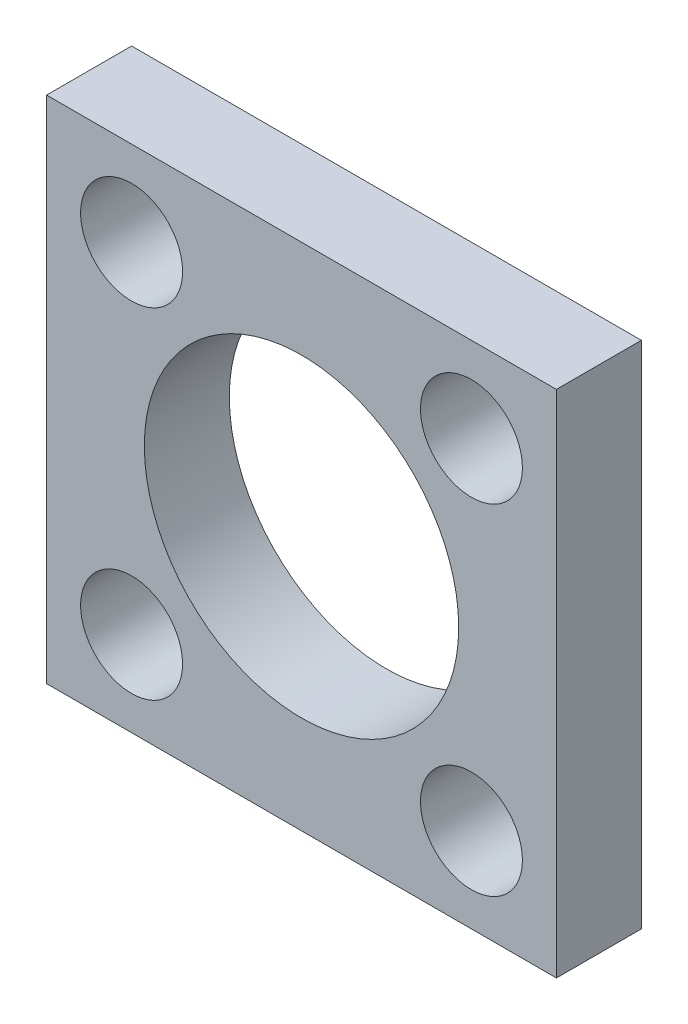
ISO-10303-21;
HEADER;
FILE_DESCRIPTION(('STEP AP214'),'2;1');
FILE_NAME('part.step','',(''),(''),'','','');
FILE_SCHEMA(('AUTOMOTIVE_DESIGN { 1 0 10303 214 1 1 1 1 }'));
ENDSEC;
DATA;
#1=APPLICATION_CONTEXT('core data for automotive mechanical design processes');
#2=APPLICATION_PROTOCOL_DEFINITION('international standard','automotive_design',2000,#1);
#3=PRODUCT_CONTEXT('',#1,'mechanical');
#4=PRODUCT('Part','Part','',(#3));
#5=PRODUCT_RELATED_PRODUCT_CATEGORY('part','',(#4));
#6=PRODUCT_DEFINITION_FORMATION('','',#4);
#7=PRODUCT_DEFINITION_CONTEXT('part definition',#1,'design');
#8=PRODUCT_DEFINITION('design','',#6,#7);
#9=PRODUCT_DEFINITION_SHAPE('','',#8);
#10=(LENGTH_UNIT() NAMED_UNIT(*) SI_UNIT(.MILLI.,.METRE.));
#11=(NAMED_UNIT(*) PLANE_ANGLE_UNIT() SI_UNIT($,.RADIAN.));
#12=(NAMED_UNIT(*) SI_UNIT($,.STERADIAN.) SOLID_ANGLE_UNIT());
#13=UNCERTAINTY_MEASURE_WITH_UNIT(LENGTH_MEASURE(1.E-05),#10,'distance_accuracy_value','');
#14=(GEOMETRIC_REPRESENTATION_CONTEXT(3) GLOBAL_UNCERTAINTY_ASSIGNED_CONTEXT((#13)) GLOBAL_UNIT_ASSIGNED_CONTEXT((#10,
#11,#12)) REPRESENTATION_CONTEXT('',''));
#15=CARTESIAN_POINT('',(0.,0.,0.));
#16=DIRECTION('',(0.,0.,1.));
#17=DIRECTION('',(1.,0.,0.));
#18=AXIS2_PLACEMENT_3D('',#15,#16,#17);
#19=CARTESIAN_POINT('',(0.,0.,10.));
#20=DIRECTION('',(0.,0.,-1.));
#21=DIRECTION('',(-1.,0.,0.));
#22=AXIS2_PLACEMENT_3D('',#19,#20,#21);
#23=PLANE('',#22);
#24=DIRECTION('',(0.,1.,0.));
#25=VECTOR('',#24,1.);
#26=CARTESIAN_POINT('',(30.,-30.,10.));
#27=LINE('',#26,#25);
#28=CARTESIAN_POINT('',(30.,-30.,10.));
#29=VERTEX_POINT('',#28);
#30=CARTESIAN_POINT('',(30.,30.,10.));
#31=VERTEX_POINT('',#30);
#32=EDGE_CURVE('E86',#29,#31,#27,.T.);
#33=ORIENTED_EDGE('',*,*,#32,.T.);
#34=DIRECTION('',(-1.,0.,0.));
#35=VECTOR('',#34,1.);
#36=CARTESIAN_POINT('',(-30.,30.,10.));
#37=LINE('',#36,#35);
#38=CARTESIAN_POINT('',(-30.,30.,10.));
#39=VERTEX_POINT('',#38);
#40=EDGE_CURVE('E81',#31,#39,#37,.T.);
#41=ORIENTED_EDGE('',*,*,#40,.T.);
#42=DIRECTION('',(0.,-1.,0.));
#43=VECTOR('',#42,1.);
#44=CARTESIAN_POINT('',(-30.,-30.,10.));
#45=LINE('',#44,#43);
#46=CARTESIAN_POINT('',(-30.,-30.,10.));
#47=VERTEX_POINT('',#46);
#48=EDGE_CURVE('E84',#39,#47,#45,.T.);
#49=ORIENTED_EDGE('',*,*,#48,.T.);
#50=DIRECTION('',(1.,0.,0.));
#51=VECTOR('',#50,1.);
#52=CARTESIAN_POINT('',(-30.,-30.,10.));
#53=LINE('',#52,#51);
#54=EDGE_CURVE('E51',#47,#29,#53,.T.);
#55=ORIENTED_EDGE('',*,*,#54,.T.);
#56=EDGE_LOOP('',(#33,#41,#49,#55));
#57=FACE_BOUND('',#56,.T.);
#58=CARTESIAN_POINT('',(0.,0.,10.));
#59=DIRECTION('',(0.,0.,1.));
#60=DIRECTION('',(1.,0.,0.));
#61=AXIS2_PLACEMENT_3D('',#58,#59,#60);
#62=CIRCLE('',#61,18.5);
#63=CARTESIAN_POINT('',(18.5,0.,10.));
#64=VERTEX_POINT('',#63);
#65=EDGE_CURVE('E101',#64,#64,#62,.T.);
#66=ORIENTED_EDGE('',*,*,#65,.F.);
#67=EDGE_LOOP('',(#66));
#68=FACE_BOUND('',#67,.T.);
#69=CARTESIAN_POINT('',(-20.,20.,10.));
#70=DIRECTION('',(0.,0.,1.));
#71=DIRECTION('',(1.,0.,0.));
#72=AXIS2_PLACEMENT_3D('',#69,#70,#71);
#73=CIRCLE('',#72,6.);
#74=CARTESIAN_POINT('',(-14.,20.,10.));
#75=VERTEX_POINT('',#74);
#76=EDGE_CURVE('E116',#75,#75,#73,.T.);
#77=ORIENTED_EDGE('',*,*,#76,.F.);
#78=EDGE_LOOP('',(#77));
#79=FACE_BOUND('',#78,.T.);
#80=CARTESIAN_POINT('',(20.,-20.,10.));
#81=DIRECTION('',(0.,0.,1.));
#82=DIRECTION('',(1.,0.,0.));
#83=AXIS2_PLACEMENT_3D('',#80,#81,#82);
#84=CIRCLE('',#83,6.);
#85=CARTESIAN_POINT('',(26.,-20.,10.));
#86=VERTEX_POINT('',#85);
#87=EDGE_CURVE('E122',#86,#86,#84,.T.);
#88=ORIENTED_EDGE('',*,*,#87,.F.);
#89=EDGE_LOOP('',(#88));
#90=FACE_BOUND('',#89,.T.);
#91=CARTESIAN_POINT('',(-20.,-20.,10.));
#92=DIRECTION('',(0.,0.,1.));
#93=DIRECTION('',(1.,0.,0.));
#94=AXIS2_PLACEMENT_3D('',#91,#92,#93);
#95=CIRCLE('',#94,6.);
#96=CARTESIAN_POINT('',(-14.,-20.,10.));
#97=VERTEX_POINT('',#96);
#98=EDGE_CURVE('E128',#97,#97,#95,.T.);
#99=ORIENTED_EDGE('',*,*,#98,.F.);
#100=EDGE_LOOP('',(#99));
#101=FACE_BOUND('',#100,.T.);
#102=CARTESIAN_POINT('',(20.,20.,10.));
#103=DIRECTION('',(0.,0.,1.));
#104=DIRECTION('',(1.,0.,0.));
#105=AXIS2_PLACEMENT_3D('',#102,#103,#104);
#106=CIRCLE('',#105,6.);
#107=CARTESIAN_POINT('',(26.,20.,10.));
#108=VERTEX_POINT('',#107);
#109=EDGE_CURVE('E134',#108,#108,#106,.T.);
#110=ORIENTED_EDGE('',*,*,#109,.F.);
#111=EDGE_LOOP('',(#110));
#112=FACE_BOUND('',#111,.T.);
#113=ADVANCED_FACE('F34',(#57,#68,#79,#90,#101,#112),#23,.F.);
#114=CARTESIAN_POINT('',(0.,0.,0.));
#115=DIRECTION('',(0.,0.,-1.));
#116=DIRECTION('',(-1.,0.,0.));
#117=AXIS2_PLACEMENT_3D('',#114,#115,#116);
#118=PLANE('',#117);
#119=CARTESIAN_POINT('',(-20.,-20.,0.));
#120=DIRECTION('',(0.,0.,1.));
#121=DIRECTION('',(1.,0.,0.));
#122=AXIS2_PLACEMENT_3D('',#119,#120,#121);
#123=CIRCLE('',#122,6.);
#124=CARTESIAN_POINT('',(-14.,-20.,0.));
#125=VERTEX_POINT('',#124);
#126=EDGE_CURVE('E131',#125,#125,#123,.T.);
#127=ORIENTED_EDGE('',*,*,#126,.T.);
#128=EDGE_LOOP('',(#127));
#129=FACE_BOUND('',#128,.T.);
#130=CARTESIAN_POINT('',(-20.,20.,0.));
#131=DIRECTION('',(0.,0.,1.));
#132=DIRECTION('',(1.,0.,0.));
#133=AXIS2_PLACEMENT_3D('',#130,#131,#132);
#134=CIRCLE('',#133,6.);
#135=CARTESIAN_POINT('',(-14.,20.,0.));
#136=VERTEX_POINT('',#135);
#137=EDGE_CURVE('E119',#136,#136,#134,.T.);
#138=ORIENTED_EDGE('',*,*,#137,.T.);
#139=EDGE_LOOP('',(#138));
#140=FACE_BOUND('',#139,.T.);
#141=DIRECTION('',(0.,1.,0.));
#142=VECTOR('',#141,1.);
#143=CARTESIAN_POINT('',(30.,-30.,0.));
#144=LINE('',#143,#142);
#145=CARTESIAN_POINT('',(30.,-30.,0.));
#146=VERTEX_POINT('',#145);
#147=CARTESIAN_POINT('',(30.,30.,0.));
#148=VERTEX_POINT('',#147);
#149=EDGE_CURVE('E98',#146,#148,#144,.T.);
#150=ORIENTED_EDGE('',*,*,#149,.F.);
#151=DIRECTION('',(1.,0.,0.));
#152=VECTOR('',#151,1.);
#153=CARTESIAN_POINT('',(-30.,-30.,0.));
#154=LINE('',#153,#152);
#155=CARTESIAN_POINT('',(-30.,-30.,0.));
#156=VERTEX_POINT('',#155);
#157=EDGE_CURVE('E74',#156,#146,#154,.T.);
#158=ORIENTED_EDGE('',*,*,#157,.F.);
#159=DIRECTION('',(0.,-1.,0.));
#160=VECTOR('',#159,1.);
#161=CARTESIAN_POINT('',(-30.,-30.,0.));
#162=LINE('',#161,#160);
#163=CARTESIAN_POINT('',(-30.,30.,0.));
#164=VERTEX_POINT('',#163);
#165=EDGE_CURVE('E68',#164,#156,#162,.T.);
#166=ORIENTED_EDGE('',*,*,#165,.F.);
#167=DIRECTION('',(-1.,0.,0.));
#168=VECTOR('',#167,1.);
#169=CARTESIAN_POINT('',(-30.,30.,0.));
#170=LINE('',#169,#168);
#171=EDGE_CURVE('E90',#148,#164,#170,.T.);
#172=ORIENTED_EDGE('',*,*,#171,.F.);
#173=EDGE_LOOP('',(#150,#158,#166,#172));
#174=FACE_BOUND('',#173,.T.);
#175=CARTESIAN_POINT('',(0.,0.,0.));
#176=DIRECTION('',(0.,0.,1.));
#177=DIRECTION('',(1.,0.,0.));
#178=AXIS2_PLACEMENT_3D('',#175,#176,#177);
#179=CIRCLE('',#178,18.5);
#180=CARTESIAN_POINT('',(18.5,0.,0.));
#181=VERTEX_POINT('',#180);
#182=EDGE_CURVE('E113',#181,#181,#179,.T.);
#183=ORIENTED_EDGE('',*,*,#182,.T.);
#184=EDGE_LOOP('',(#183));
#185=FACE_BOUND('',#184,.T.);
#186=CARTESIAN_POINT('',(20.,-20.,0.));
#187=DIRECTION('',(0.,0.,1.));
#188=DIRECTION('',(1.,0.,0.));
#189=AXIS2_PLACEMENT_3D('',#186,#187,#188);
#190=CIRCLE('',#189,6.);
#191=CARTESIAN_POINT('',(26.,-20.,0.));
#192=VERTEX_POINT('',#191);
#193=EDGE_CURVE('E125',#192,#192,#190,.T.);
#194=ORIENTED_EDGE('',*,*,#193,.T.);
#195=EDGE_LOOP('',(#194));
#196=FACE_BOUND('',#195,.T.);
#197=CARTESIAN_POINT('',(20.,20.,0.));
#198=DIRECTION('',(0.,0.,1.));
#199=DIRECTION('',(1.,0.,0.));
#200=AXIS2_PLACEMENT_3D('',#197,#198,#199);
#201=CIRCLE('',#200,6.);
#202=CARTESIAN_POINT('',(26.,20.,0.));
#203=VERTEX_POINT('',#202);
#204=EDGE_CURVE('E137',#203,#203,#201,.T.);
#205=ORIENTED_EDGE('',*,*,#204,.T.);
#206=EDGE_LOOP('',(#205));
#207=FACE_BOUND('',#206,.T.);
#208=ADVANCED_FACE('F109',(#129,#140,#174,#185,#196,#207),#118,.T.);
#209=CARTESIAN_POINT('',(30.,-30.,10.));
#210=DIRECTION('',(-1.,0.,0.));
#211=DIRECTION('',(0.,0.,1.));
#212=AXIS2_PLACEMENT_3D('',#209,#210,#211);
#213=PLANE('',#212);
#214=ORIENTED_EDGE('',*,*,#149,.T.);
#215=DIRECTION('',(0.,0.,-1.));
#216=VECTOR('',#215,1.);
#217=CARTESIAN_POINT('',(30.,30.,10.));
#218=LINE('',#217,#216);
#219=EDGE_CURVE('E11',#31,#148,#218,.T.);
#220=ORIENTED_EDGE('',*,*,#219,.F.);
#221=ORIENTED_EDGE('',*,*,#32,.F.);
#222=DIRECTION('',(0.,0.,-1.));
#223=VECTOR('',#222,1.);
#224=CARTESIAN_POINT('',(30.,-30.,10.));
#225=LINE('',#224,#223);
#226=EDGE_CURVE('E94',#29,#146,#225,.T.);
#227=ORIENTED_EDGE('',*,*,#226,.T.);
#228=EDGE_LOOP('',(#214,#220,#221,#227));
#229=FACE_BOUND('',#228,.T.);
#230=ADVANCED_FACE('F36',(#229),#213,.F.);
#231=CARTESIAN_POINT('',(-30.,30.,10.));
#232=DIRECTION('',(0.,-1.,0.));
#233=DIRECTION('',(0.,0.,-1.));
#234=AXIS2_PLACEMENT_3D('',#231,#232,#233);
#235=PLANE('',#234);
#236=ORIENTED_EDGE('',*,*,#171,.T.);
#237=DIRECTION('',(0.,0.,-1.));
#238=VECTOR('',#237,1.);
#239=CARTESIAN_POINT('',(-30.,30.,10.));
#240=LINE('',#239,#238);
#241=EDGE_CURVE('E43',#39,#164,#240,.T.);
#242=ORIENTED_EDGE('',*,*,#241,.F.);
#243=ORIENTED_EDGE('',*,*,#40,.F.);
#244=ORIENTED_EDGE('',*,*,#219,.T.);
#245=EDGE_LOOP('',(#236,#242,#243,#244));
#246=FACE_BOUND('',#245,.T.);
#247=ADVANCED_FACE('F89',(#246),#235,.F.);
#248=CARTESIAN_POINT('',(-30.,-30.,10.));
#249=DIRECTION('',(1.,0.,0.));
#250=DIRECTION('',(0.,0.,-1.));
#251=AXIS2_PLACEMENT_3D('',#248,#249,#250);
#252=PLANE('',#251);
#253=ORIENTED_EDGE('',*,*,#165,.T.);
#254=DIRECTION('',(0.,0.,-1.));
#255=VECTOR('',#254,1.);
#256=CARTESIAN_POINT('',(-30.,-30.,10.));
#257=LINE('',#256,#255);
#258=EDGE_CURVE('E91',#47,#156,#257,.T.);
#259=ORIENTED_EDGE('',*,*,#258,.F.);
#260=ORIENTED_EDGE('',*,*,#48,.F.);
#261=ORIENTED_EDGE('',*,*,#241,.T.);
#262=EDGE_LOOP('',(#253,#259,#260,#261));
#263=FACE_BOUND('',#262,.T.);
#264=ADVANCED_FACE('F92',(#263),#252,.F.);
#265=CARTESIAN_POINT('',(-30.,-30.,10.));
#266=DIRECTION('',(0.,1.,0.));
#267=DIRECTION('',(0.,0.,1.));
#268=AXIS2_PLACEMENT_3D('',#265,#266,#267);
#269=PLANE('',#268);
#270=ORIENTED_EDGE('',*,*,#157,.T.);
#271=ORIENTED_EDGE('',*,*,#226,.F.);
#272=ORIENTED_EDGE('',*,*,#54,.F.);
#273=ORIENTED_EDGE('',*,*,#258,.T.);
#274=EDGE_LOOP('',(#270,#271,#272,#273));
#275=FACE_BOUND('',#274,.T.);
#276=ADVANCED_FACE('F106',(#275),#269,.F.);
#277=CARTESIAN_POINT('',(0.,0.,10.));
#278=DIRECTION('',(0.,0.,-1.));
#279=DIRECTION('',(-1.,0.,0.));
#280=AXIS2_PLACEMENT_3D('',#277,#278,#279);
#281=CYLINDRICAL_SURFACE('',#280,18.5);
#282=ORIENTED_EDGE('',*,*,#65,.T.);
#283=EDGE_LOOP('',(#282));
#284=FACE_BOUND('',#283,.T.);
#285=ORIENTED_EDGE('',*,*,#182,.F.);
#286=EDGE_LOOP('',(#285));
#287=FACE_BOUND('',#286,.T.);
#288=ADVANCED_FACE('F154',(#284,#287),#281,.F.);
#289=CARTESIAN_POINT('',(-20.,20.,10.));
#290=DIRECTION('',(0.,0.,-1.));
#291=DIRECTION('',(-1.,0.,0.));
#292=AXIS2_PLACEMENT_3D('',#289,#290,#291);
#293=CYLINDRICAL_SURFACE('',#292,6.);
#294=ORIENTED_EDGE('',*,*,#76,.T.);
#295=EDGE_LOOP('',(#294));
#296=FACE_BOUND('',#295,.T.);
#297=ORIENTED_EDGE('',*,*,#137,.F.);
#298=EDGE_LOOP('',(#297));
#299=FACE_BOUND('',#298,.T.);
#300=ADVANCED_FACE('F200',(#296,#299),#293,.F.);
#301=CARTESIAN_POINT('',(20.,-20.,10.));
#302=DIRECTION('',(0.,0.,-1.));
#303=DIRECTION('',(-1.,0.,0.));
#304=AXIS2_PLACEMENT_3D('',#301,#302,#303);
#305=CYLINDRICAL_SURFACE('',#304,6.);
#306=ORIENTED_EDGE('',*,*,#87,.T.);
#307=EDGE_LOOP('',(#306));
#308=FACE_BOUND('',#307,.T.);
#309=ORIENTED_EDGE('',*,*,#193,.F.);
#310=EDGE_LOOP('',(#309));
#311=FACE_BOUND('',#310,.T.);
#312=ADVANCED_FACE('F208',(#308,#311),#305,.F.);
#313=CARTESIAN_POINT('',(-20.,-20.,10.));
#314=DIRECTION('',(0.,0.,-1.));
#315=DIRECTION('',(-1.,0.,0.));
#316=AXIS2_PLACEMENT_3D('',#313,#314,#315);
#317=CYLINDRICAL_SURFACE('',#316,6.);
#318=ORIENTED_EDGE('',*,*,#98,.T.);
#319=EDGE_LOOP('',(#318));
#320=FACE_BOUND('',#319,.T.);
#321=ORIENTED_EDGE('',*,*,#126,.F.);
#322=EDGE_LOOP('',(#321));
#323=FACE_BOUND('',#322,.T.);
#324=ADVANCED_FACE('F216',(#320,#323),#317,.F.);
#325=CARTESIAN_POINT('',(20.,20.,10.));
#326=DIRECTION('',(0.,0.,-1.));
#327=DIRECTION('',(-1.,0.,0.));
#328=AXIS2_PLACEMENT_3D('',#325,#326,#327);
#329=CYLINDRICAL_SURFACE('',#328,6.);
#330=ORIENTED_EDGE('',*,*,#109,.T.);
#331=EDGE_LOOP('',(#330));
#332=FACE_BOUND('',#331,.T.);
#333=ORIENTED_EDGE('',*,*,#204,.F.);
#334=EDGE_LOOP('',(#333));
#335=FACE_BOUND('',#334,.T.);
#336=ADVANCED_FACE('F143',(#332,#335),#329,.F.);
#337=CLOSED_SHELL('',(#113,#208,#230,#247,#264,#276,#288,#300,#312,#324,#336));
#338=MANIFOLD_SOLID_BREP('B2',#337);
#339=ADVANCED_BREP_SHAPE_REPRESENTATION('',(#18,#338),#14);
#340=SHAPE_DEFINITION_REPRESENTATION(#9,#339);
ENDSEC;
END-ISO-10303-21;
